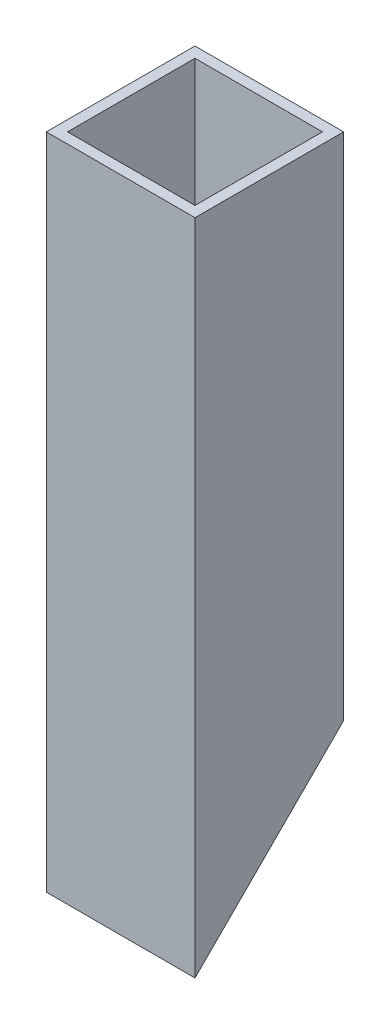
ISO-10303-21;
HEADER;
FILE_DESCRIPTION(('STEP AP214'),'2;1');
FILE_NAME('part.step','',(''),(''),'','','');
FILE_SCHEMA(('AUTOMOTIVE_DESIGN { 1 0 10303 214 1 1 1 1 }'));
ENDSEC;
DATA;
#1=APPLICATION_CONTEXT('core data for automotive mechanical design processes');
#2=APPLICATION_PROTOCOL_DEFINITION('international standard','automotive_design',2000,#1);
#3=PRODUCT_CONTEXT('',#1,'mechanical');
#4=PRODUCT('Part','Part','',(#3));
#5=PRODUCT_RELATED_PRODUCT_CATEGORY('part','',(#4));
#6=PRODUCT_DEFINITION_FORMATION('','',#4);
#7=PRODUCT_DEFINITION_CONTEXT('part definition',#1,'design');
#8=PRODUCT_DEFINITION('design','',#6,#7);
#9=PRODUCT_DEFINITION_SHAPE('','',#8);
#10=(LENGTH_UNIT() NAMED_UNIT(*) SI_UNIT(.MILLI.,.METRE.));
#11=(NAMED_UNIT(*) PLANE_ANGLE_UNIT() SI_UNIT($,.RADIAN.));
#12=(NAMED_UNIT(*) SI_UNIT($,.STERADIAN.) SOLID_ANGLE_UNIT());
#13=UNCERTAINTY_MEASURE_WITH_UNIT(LENGTH_MEASURE(1.E-05),#10,'distance_accuracy_value','');
#14=(GEOMETRIC_REPRESENTATION_CONTEXT(3) GLOBAL_UNCERTAINTY_ASSIGNED_CONTEXT((#13)) GLOBAL_UNIT_ASSIGNED_CONTEXT((#10,
#11,#12)) REPRESENTATION_CONTEXT('',''));
#15=CARTESIAN_POINT('',(0.,0.,0.));
#16=DIRECTION('',(0.,0.,1.));
#17=DIRECTION('',(1.,0.,0.));
#18=AXIS2_PLACEMENT_3D('',#15,#16,#17);
#19=CARTESIAN_POINT('',(0.,196.85,0.));
#20=DIRECTION('',(0.,-1.,0.));
#21=DIRECTION('',(0.,0.,1.));
#22=AXIS2_PLACEMENT_3D('',#19,#20,#21);
#23=PLANE('',#22);
#24=DIRECTION('',(0.,0.,-1.));
#25=VECTOR('',#24,1.);
#26=CARTESIAN_POINT('',(0.,196.85,0.));
#27=LINE('',#26,#25);
#28=CARTESIAN_POINT('',(0.,196.85,44.45));
#29=VERTEX_POINT('',#28);
#30=CARTESIAN_POINT('',(0.,196.85,0.));
#31=VERTEX_POINT('',#30);
#32=EDGE_CURVE('E112',#29,#31,#27,.T.);
#33=ORIENTED_EDGE('',*,*,#32,.F.);
#34=DIRECTION('',(-1.,0.,0.));
#35=VECTOR('',#34,1.);
#36=CARTESIAN_POINT('',(0.,196.85,44.45));
#37=LINE('',#36,#35);
#38=CARTESIAN_POINT('',(44.45,196.85,44.45));
#39=VERTEX_POINT('',#38);
#40=EDGE_CURVE('E121',#39,#29,#37,.T.);
#41=ORIENTED_EDGE('',*,*,#40,.F.);
#42=DIRECTION('',(0.,0.,1.));
#43=VECTOR('',#42,1.);
#44=CARTESIAN_POINT('',(44.45,196.85,0.));
#45=LINE('',#44,#43);
#46=CARTESIAN_POINT('',(44.45,196.85,0.));
#47=VERTEX_POINT('',#46);
#48=EDGE_CURVE('E118',#47,#39,#45,.T.);
#49=ORIENTED_EDGE('',*,*,#48,.F.);
#50=DIRECTION('',(1.,0.,0.));
#51=VECTOR('',#50,1.);
#52=CARTESIAN_POINT('',(0.,196.85,0.));
#53=LINE('',#52,#51);
#54=EDGE_CURVE('E115',#31,#47,#53,.T.);
#55=ORIENTED_EDGE('',*,*,#54,.F.);
#56=EDGE_LOOP('',(#33,#41,#49,#55));
#57=FACE_BOUND('',#56,.T.);
#58=DIRECTION('',(1.,0.,0.));
#59=VECTOR('',#58,1.);
#60=CARTESIAN_POINT('',(3.175,196.85,3.175));
#61=LINE('',#60,#59);
#62=CARTESIAN_POINT('',(3.175,196.85,3.175));
#63=VERTEX_POINT('',#62);
#64=CARTESIAN_POINT('',(41.275,196.85,3.175));
#65=VERTEX_POINT('',#64);
#66=EDGE_CURVE('E96',#63,#65,#61,.T.);
#67=ORIENTED_EDGE('',*,*,#66,.T.);
#68=DIRECTION('',(0.,0.,1.));
#69=VECTOR('',#68,1.);
#70=CARTESIAN_POINT('',(41.275,196.85,3.175));
#71=LINE('',#70,#69);
#72=CARTESIAN_POINT('',(41.275,196.85,41.275));
#73=VERTEX_POINT('',#72);
#74=EDGE_CURVE('E84',#65,#73,#71,.T.);
#75=ORIENTED_EDGE('',*,*,#74,.T.);
#76=DIRECTION('',(-1.,0.,0.));
#77=VECTOR('',#76,1.);
#78=CARTESIAN_POINT('',(3.175,196.85,41.275));
#79=LINE('',#78,#77);
#80=CARTESIAN_POINT('',(3.175,196.85,41.275));
#81=VERTEX_POINT('',#80);
#82=EDGE_CURVE('E107',#73,#81,#79,.T.);
#83=ORIENTED_EDGE('',*,*,#82,.T.);
#84=DIRECTION('',(0.,0.,-1.));
#85=VECTOR('',#84,1.);
#86=CARTESIAN_POINT('',(3.175,196.85,3.175));
#87=LINE('',#86,#85);
#88=EDGE_CURVE('E103',#81,#63,#87,.T.);
#89=ORIENTED_EDGE('',*,*,#88,.T.);
#90=EDGE_LOOP('',(#67,#75,#83,#89));
#91=FACE_BOUND('',#90,.T.);
#92=ADVANCED_FACE('F35',(#57,#91),#23,.F.);
#93=CARTESIAN_POINT('',(0.,196.85,0.));
#94=DIRECTION('',(1.,0.,0.));
#95=DIRECTION('',(0.,0.,1.));
#96=AXIS2_PLACEMENT_3D('',#93,#94,#95);
#97=PLANE('',#96);
#98=DIRECTION('',(0.,-1.,0.));
#99=VECTOR('',#98,1.);
#100=CARTESIAN_POINT('',(0.,196.85,44.45));
#101=LINE('',#100,#99);
#102=CARTESIAN_POINT('',(0.,0.,44.45));
#103=VERTEX_POINT('',#102);
#104=EDGE_CURVE('E124',#29,#103,#101,.T.);
#105=ORIENTED_EDGE('',*,*,#104,.F.);
#106=ORIENTED_EDGE('',*,*,#32,.T.);
#107=DIRECTION('',(0.,-1.,0.));
#108=VECTOR('',#107,1.);
#109=CARTESIAN_POINT('',(0.,196.85,0.));
#110=LINE('',#109,#108);
#111=CARTESIAN_POINT('',(0.,44.45,0.));
#112=VERTEX_POINT('',#111);
#113=EDGE_CURVE('E134',#31,#112,#110,.T.);
#114=ORIENTED_EDGE('',*,*,#113,.T.);
#115=DIRECTION('',(0.,0.707106781186546,-0.707106781186549));
#116=VECTOR('',#115,1.);
#117=CARTESIAN_POINT('',(0.,44.45,0.));
#118=LINE('',#117,#116);
#119=EDGE_CURVE('E11',#103,#112,#118,.T.);
#120=ORIENTED_EDGE('',*,*,#119,.F.);
#121=EDGE_LOOP('',(#105,#106,#114,#120));
#122=FACE_BOUND('',#121,.T.);
#123=ADVANCED_FACE('F170',(#122),#97,.F.);
#124=CARTESIAN_POINT('',(0.,196.85,0.));
#125=DIRECTION('',(0.,0.,1.));
#126=DIRECTION('',(-1.,0.,0.));
#127=AXIS2_PLACEMENT_3D('',#124,#125,#126);
#128=PLANE('',#127);
#129=ORIENTED_EDGE('',*,*,#113,.F.);
#130=ORIENTED_EDGE('',*,*,#54,.T.);
#131=DIRECTION('',(0.,-1.,0.));
#132=VECTOR('',#131,1.);
#133=CARTESIAN_POINT('',(44.45,196.85,0.));
#134=LINE('',#133,#132);
#135=CARTESIAN_POINT('',(44.45,44.45,0.));
#136=VERTEX_POINT('',#135);
#137=EDGE_CURVE('E132',#47,#136,#134,.T.);
#138=ORIENTED_EDGE('',*,*,#137,.T.);
#139=DIRECTION('',(1.,0.,0.));
#140=VECTOR('',#139,1.);
#141=CARTESIAN_POINT('',(44.45,44.45,0.));
#142=LINE('',#141,#140);
#143=EDGE_CURVE('E54',#112,#136,#142,.T.);
#144=ORIENTED_EDGE('',*,*,#143,.F.);
#145=EDGE_LOOP('',(#129,#130,#138,#144));
#146=FACE_BOUND('',#145,.T.);
#147=ADVANCED_FACE('F178',(#146),#128,.F.);
#148=CARTESIAN_POINT('',(44.45,196.85,0.));
#149=DIRECTION('',(-1.,0.,0.));
#150=DIRECTION('',(0.,0.,-1.));
#151=AXIS2_PLACEMENT_3D('',#148,#149,#150);
#152=PLANE('',#151);
#153=ORIENTED_EDGE('',*,*,#137,.F.);
#154=ORIENTED_EDGE('',*,*,#48,.T.);
#155=DIRECTION('',(0.,-1.,0.));
#156=VECTOR('',#155,1.);
#157=CARTESIAN_POINT('',(44.45,196.85,44.45));
#158=LINE('',#157,#156);
#159=CARTESIAN_POINT('',(44.45,0.,44.45));
#160=VERTEX_POINT('',#159);
#161=EDGE_CURVE('E129',#39,#160,#158,.T.);
#162=ORIENTED_EDGE('',*,*,#161,.T.);
#163=DIRECTION('',(0.,-0.707106781186546,0.707106781186549));
#164=VECTOR('',#163,1.);
#165=CARTESIAN_POINT('',(44.45,44.45,0.));
#166=LINE('',#165,#164);
#167=EDGE_CURVE('E45',#136,#160,#166,.T.);
#168=ORIENTED_EDGE('',*,*,#167,.F.);
#169=EDGE_LOOP('',(#153,#154,#162,#168));
#170=FACE_BOUND('',#169,.T.);
#171=ADVANCED_FACE('F180',(#170),#152,.F.);
#172=CARTESIAN_POINT('',(0.,196.85,44.45));
#173=DIRECTION('',(0.,0.,-1.));
#174=DIRECTION('',(1.,0.,0.));
#175=AXIS2_PLACEMENT_3D('',#172,#173,#174);
#176=PLANE('',#175);
#177=DIRECTION('',(-1.,0.,0.));
#178=VECTOR('',#177,1.);
#179=CARTESIAN_POINT('',(0.,0.,44.45));
#180=LINE('',#179,#178);
#181=EDGE_CURVE('E88',#160,#103,#180,.T.);
#182=ORIENTED_EDGE('',*,*,#181,.F.);
#183=ORIENTED_EDGE('',*,*,#161,.F.);
#184=ORIENTED_EDGE('',*,*,#40,.T.);
#185=ORIENTED_EDGE('',*,*,#104,.T.);
#186=EDGE_LOOP('',(#182,#183,#184,#185));
#187=FACE_BOUND('',#186,.T.);
#188=ADVANCED_FACE('F171',(#187),#176,.F.);
#189=CARTESIAN_POINT('',(3.175,196.85,3.175));
#190=DIRECTION('',(0.,0.,1.));
#191=DIRECTION('',(-1.,0.,0.));
#192=AXIS2_PLACEMENT_3D('',#189,#190,#191);
#193=PLANE('',#192);
#194=DIRECTION('',(1.,0.,0.));
#195=VECTOR('',#194,1.);
#196=CARTESIAN_POINT('',(0.,41.275,3.175));
#197=LINE('',#196,#195);
#198=CARTESIAN_POINT('',(3.175,41.275,3.175));
#199=VERTEX_POINT('',#198);
#200=CARTESIAN_POINT('',(41.275,41.275,3.175));
#201=VERTEX_POINT('',#200);
#202=EDGE_CURVE('E39',#199,#201,#197,.T.);
#203=ORIENTED_EDGE('',*,*,#202,.T.);
#204=DIRECTION('',(0.,-1.,0.));
#205=VECTOR('',#204,1.);
#206=CARTESIAN_POINT('',(41.275,196.85,3.175));
#207=LINE('',#206,#205);
#208=EDGE_CURVE('E81',#65,#201,#207,.T.);
#209=ORIENTED_EDGE('',*,*,#208,.F.);
#210=ORIENTED_EDGE('',*,*,#66,.F.);
#211=DIRECTION('',(0.,-1.,0.));
#212=VECTOR('',#211,1.);
#213=CARTESIAN_POINT('',(3.175,196.85,3.175));
#214=LINE('',#213,#212);
#215=EDGE_CURVE('E94',#63,#199,#214,.T.);
#216=ORIENTED_EDGE('',*,*,#215,.T.);
#217=EDGE_LOOP('',(#203,#209,#210,#216));
#218=FACE_BOUND('',#217,.T.);
#219=ADVANCED_FACE('F92',(#218),#193,.T.);
#220=CARTESIAN_POINT('',(41.275,196.85,3.175));
#221=DIRECTION('',(-1.,0.,0.));
#222=DIRECTION('',(0.,0.,-1.));
#223=AXIS2_PLACEMENT_3D('',#220,#221,#222);
#224=PLANE('',#223);
#225=DIRECTION('',(0.,-0.707106781186546,0.707106781186549));
#226=VECTOR('',#225,1.);
#227=CARTESIAN_POINT('',(41.275,44.45,0.));
#228=LINE('',#227,#226);
#229=CARTESIAN_POINT('',(41.275,3.17500000000018,41.275));
#230=VERTEX_POINT('',#229);
#231=EDGE_CURVE('E71',#201,#230,#228,.T.);
#232=ORIENTED_EDGE('',*,*,#231,.T.);
#233=DIRECTION('',(0.,-1.,0.));
#234=VECTOR('',#233,1.);
#235=CARTESIAN_POINT('',(41.275,196.85,41.275));
#236=LINE('',#235,#234);
#237=EDGE_CURVE('E89',#73,#230,#236,.T.);
#238=ORIENTED_EDGE('',*,*,#237,.F.);
#239=ORIENTED_EDGE('',*,*,#74,.F.);
#240=ORIENTED_EDGE('',*,*,#208,.T.);
#241=EDGE_LOOP('',(#232,#238,#239,#240));
#242=FACE_BOUND('',#241,.T.);
#243=ADVANCED_FACE('F82',(#242),#224,.T.);
#244=CARTESIAN_POINT('',(3.175,196.85,41.275));
#245=DIRECTION('',(0.,0.,-1.));
#246=DIRECTION('',(1.,0.,0.));
#247=AXIS2_PLACEMENT_3D('',#244,#245,#246);
#248=PLANE('',#247);
#249=DIRECTION('',(-1.,0.,0.));
#250=VECTOR('',#249,1.);
#251=CARTESIAN_POINT('',(0.,3.17500000000015,41.275));
#252=LINE('',#251,#250);
#253=CARTESIAN_POINT('',(3.175,3.17500000000018,41.275));
#254=VERTEX_POINT('',#253);
#255=EDGE_CURVE('E75',#230,#254,#252,.T.);
#256=ORIENTED_EDGE('',*,*,#255,.T.);
#257=DIRECTION('',(0.,-1.,0.));
#258=VECTOR('',#257,1.);
#259=CARTESIAN_POINT('',(3.175,196.85,41.275));
#260=LINE('',#259,#258);
#261=EDGE_CURVE('E102',#81,#254,#260,.T.);
#262=ORIENTED_EDGE('',*,*,#261,.F.);
#263=ORIENTED_EDGE('',*,*,#82,.F.);
#264=ORIENTED_EDGE('',*,*,#237,.T.);
#265=EDGE_LOOP('',(#256,#262,#263,#264));
#266=FACE_BOUND('',#265,.T.);
#267=ADVANCED_FACE('F144',(#266),#248,.T.);
#268=CARTESIAN_POINT('',(3.175,196.85,3.175));
#269=DIRECTION('',(1.,0.,0.));
#270=DIRECTION('',(0.,0.,1.));
#271=AXIS2_PLACEMENT_3D('',#268,#269,#270);
#272=PLANE('',#271);
#273=DIRECTION('',(0.,0.707106781186546,-0.707106781186549));
#274=VECTOR('',#273,1.);
#275=CARTESIAN_POINT('',(3.175,44.45,0.));
#276=LINE('',#275,#274);
#277=EDGE_CURVE('E140',#254,#199,#276,.T.);
#278=ORIENTED_EDGE('',*,*,#277,.T.);
#279=ORIENTED_EDGE('',*,*,#215,.F.);
#280=ORIENTED_EDGE('',*,*,#88,.F.);
#281=ORIENTED_EDGE('',*,*,#261,.T.);
#282=EDGE_LOOP('',(#278,#279,#280,#281));
#283=FACE_BOUND('',#282,.T.);
#284=ADVANCED_FACE('F201',(#283),#272,.T.);
#285=CARTESIAN_POINT('',(0.,44.45,0.));
#286=DIRECTION('',(0.,-0.707106781186549,-0.707106781186546));
#287=DIRECTION('',(-1.,0.,0.));
#288=AXIS2_PLACEMENT_3D('',#285,#286,#287);
#289=PLANE('',#288);
#290=ORIENTED_EDGE('',*,*,#119,.T.);
#291=ORIENTED_EDGE('',*,*,#143,.T.);
#292=ORIENTED_EDGE('',*,*,#167,.T.);
#293=ORIENTED_EDGE('',*,*,#181,.T.);
#294=EDGE_LOOP('',(#290,#291,#292,#293));
#295=FACE_BOUND('',#294,.T.);
#296=ORIENTED_EDGE('',*,*,#277,.F.);
#297=ORIENTED_EDGE('',*,*,#255,.F.);
#298=ORIENTED_EDGE('',*,*,#231,.F.);
#299=ORIENTED_EDGE('',*,*,#202,.F.);
#300=EDGE_LOOP('',(#296,#297,#298,#299));
#301=FACE_BOUND('',#300,.T.);
#302=ADVANCED_FACE('F37',(#295,#301),#289,.T.);
#303=CLOSED_SHELL('',(#92,#123,#147,#171,#188,#219,#243,#267,#284,#302));
#304=MANIFOLD_SOLID_BREP('B2',#303);
#305=ADVANCED_BREP_SHAPE_REPRESENTATION('',(#18,#304),#14);
#306=SHAPE_DEFINITION_REPRESENTATION(#9,#305);
ENDSEC;
END-ISO-10303-21;
